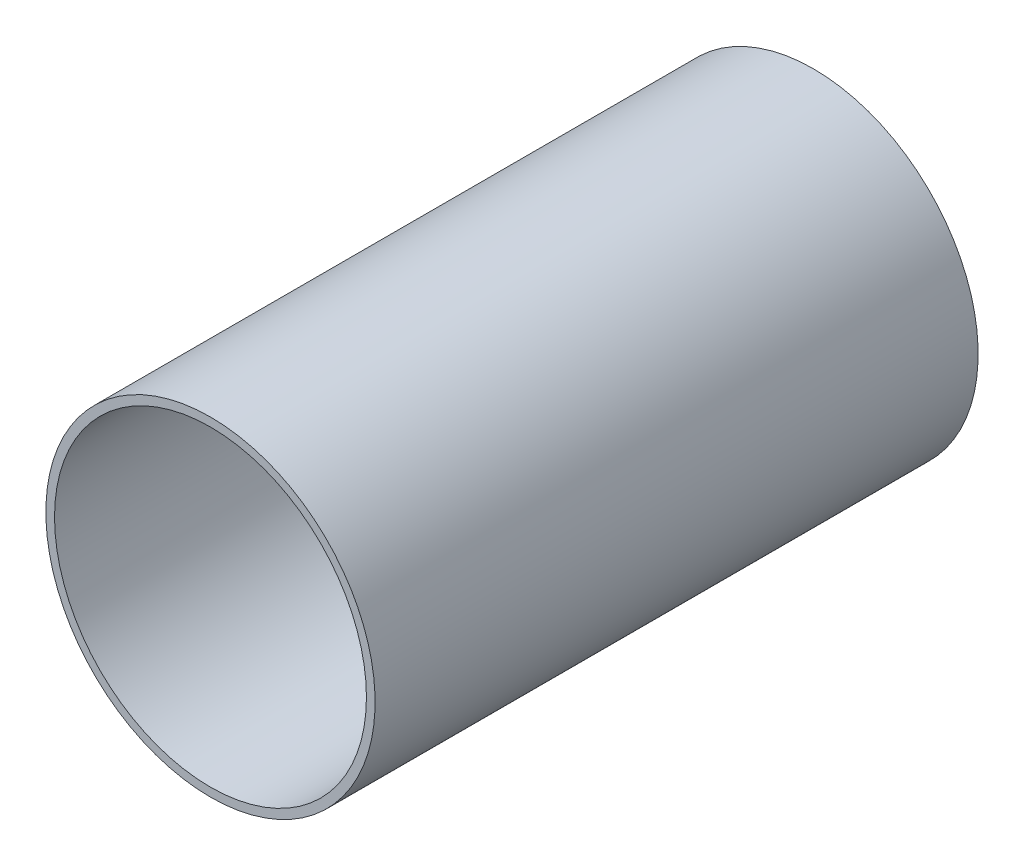
ISO-10303-21;
HEADER;
FILE_DESCRIPTION(('STEP AP214'),'2;1');
FILE_NAME('part.step','',(''),(''),'','','');
FILE_SCHEMA(('AUTOMOTIVE_DESIGN { 1 0 10303 214 1 1 1 1 }'));
ENDSEC;
DATA;
#1=APPLICATION_CONTEXT('core data for automotive mechanical design processes');
#2=APPLICATION_PROTOCOL_DEFINITION('international standard','automotive_design',2000,#1);
#3=PRODUCT_CONTEXT('',#1,'mechanical');
#4=PRODUCT('Part','Part','',(#3));
#5=PRODUCT_RELATED_PRODUCT_CATEGORY('part','',(#4));
#6=PRODUCT_DEFINITION_FORMATION('','',#4);
#7=PRODUCT_DEFINITION_CONTEXT('part definition',#1,'design');
#8=PRODUCT_DEFINITION('design','',#6,#7);
#9=PRODUCT_DEFINITION_SHAPE('','',#8);
#10=(LENGTH_UNIT() NAMED_UNIT(*) SI_UNIT(.MILLI.,.METRE.));
#11=(NAMED_UNIT(*) PLANE_ANGLE_UNIT() SI_UNIT($,.RADIAN.));
#12=(NAMED_UNIT(*) SI_UNIT($,.STERADIAN.) SOLID_ANGLE_UNIT());
#13=UNCERTAINTY_MEASURE_WITH_UNIT(LENGTH_MEASURE(1.E-05),#10,'distance_accuracy_value','');
#14=(GEOMETRIC_REPRESENTATION_CONTEXT(3) GLOBAL_UNCERTAINTY_ASSIGNED_CONTEXT((#13)) GLOBAL_UNIT_ASSIGNED_CONTEXT((#10,
#11,#12)) REPRESENTATION_CONTEXT('',''));
#15=CARTESIAN_POINT('',(0.,0.,0.));
#16=DIRECTION('',(0.,0.,1.));
#17=DIRECTION('',(1.,0.,0.));
#18=AXIS2_PLACEMENT_3D('',#15,#16,#17);
#19=CARTESIAN_POINT('',(177.26,-119.456,-0.045));
#20=DIRECTION('',(0.,0.,-1.));
#21=DIRECTION('',(0.,-1.,0.));
#22=AXIS2_PLACEMENT_3D('',#19,#20,#21);
#23=CYLINDRICAL_SURFACE('',#22,0.45);
#24=CARTESIAN_POINT('',(177.26,-119.456,-0.035));
#25=DIRECTION('',(0.,0.,-1.));
#26=DIRECTION('',(0.,-1.,0.));
#27=AXIS2_PLACEMENT_3D('',#24,#25,#26);
#28=CIRCLE('',#27,0.45);
#29=CARTESIAN_POINT('',(177.26,-119.906,-0.035));
#30=VERTEX_POINT('',#29);
#31=EDGE_CURVE('E65',#30,#30,#28,.T.);
#32=ORIENTED_EDGE('',*,*,#31,.T.);
#33=DIRECTION('',(0.,0.,1.));
#34=VECTOR('',#33,1.);
#35=CARTESIAN_POINT('',(177.26,-119.906,-0.045));
#36=LINE('',#35,#34);
#37=CARTESIAN_POINT('',(177.26,-119.906,1.705));
#38=VERTEX_POINT('',#37);
#39=EDGE_CURVE('E11',#30,#38,#36,.T.);
#40=ORIENTED_EDGE('',*,*,#39,.T.);
#41=CARTESIAN_POINT('',(177.26,-119.456,1.705));
#42=DIRECTION('',(0.,0.,-1.));
#43=DIRECTION('',(0.,-1.,0.));
#44=AXIS2_PLACEMENT_3D('',#41,#42,#43);
#45=CIRCLE('',#44,0.45);
#46=EDGE_CURVE('E26',#38,#38,#45,.T.);
#47=ORIENTED_EDGE('',*,*,#46,.F.);
#48=ORIENTED_EDGE('',*,*,#39,.F.);
#49=EDGE_LOOP('',(#32,#40,#47,#48));
#50=FACE_BOUND('',#49,.T.);
#51=ADVANCED_FACE('F17',(#50),#23,.F.);
#52=CARTESIAN_POINT('',(177.26,-119.931,1.705));
#53=DIRECTION('',(0.,0.,1.));
#54=DIRECTION('',(1.,0.,0.));
#55=AXIS2_PLACEMENT_3D('',#52,#53,#54);
#56=PLANE('',#55);
#57=ORIENTED_EDGE('',*,*,#46,.T.);
#58=EDGE_LOOP('',(#57));
#59=FACE_BOUND('',#58,.T.);
#60=CARTESIAN_POINT('',(177.26,-119.456,1.705));
#61=DIRECTION('',(0.,0.,1.));
#62=DIRECTION('',(0.,-1.,0.));
#63=AXIS2_PLACEMENT_3D('',#60,#61,#62);
#64=CIRCLE('',#63,0.475);
#65=CARTESIAN_POINT('',(177.26,-119.931,1.705));
#66=VERTEX_POINT('',#65);
#67=EDGE_CURVE('E57',#66,#66,#64,.T.);
#68=ORIENTED_EDGE('',*,*,#67,.T.);
#69=EDGE_LOOP('',(#68));
#70=FACE_BOUND('',#69,.T.);
#71=ADVANCED_FACE('F19',(#59,#70),#56,.T.);
#72=CARTESIAN_POINT('',(177.26,-119.931,-0.035));
#73=DIRECTION('',(0.,0.,1.));
#74=DIRECTION('',(1.,0.,0.));
#75=AXIS2_PLACEMENT_3D('',#72,#73,#74);
#76=PLANE('',#75);
#77=ORIENTED_EDGE('',*,*,#31,.F.);
#78=EDGE_LOOP('',(#77));
#79=FACE_BOUND('',#78,.T.);
#80=CARTESIAN_POINT('',(177.26,-119.456,-0.035));
#81=DIRECTION('',(0.,0.,1.));
#82=DIRECTION('',(0.,-1.,0.));
#83=AXIS2_PLACEMENT_3D('',#80,#81,#82);
#84=CIRCLE('',#83,0.475);
#85=CARTESIAN_POINT('',(177.26,-119.931,-0.035));
#86=VERTEX_POINT('',#85);
#87=EDGE_CURVE('E56',#86,#86,#84,.T.);
#88=ORIENTED_EDGE('',*,*,#87,.F.);
#89=EDGE_LOOP('',(#88));
#90=FACE_BOUND('',#89,.T.);
#91=ADVANCED_FACE('F78',(#79,#90),#76,.F.);
#92=CARTESIAN_POINT('',(177.26,-119.456,-0.035));
#93=DIRECTION('',(0.,0.,-1.));
#94=DIRECTION('',(0.,-1.,0.));
#95=AXIS2_PLACEMENT_3D('',#92,#93,#94);
#96=CYLINDRICAL_SURFACE('',#95,0.475);
#97=ORIENTED_EDGE('',*,*,#87,.T.);
#98=DIRECTION('',(0.,0.,1.));
#99=VECTOR('',#98,1.);
#100=CARTESIAN_POINT('',(177.26,-119.931,-0.035));
#101=LINE('',#100,#99);
#102=EDGE_CURVE('E53',#86,#66,#101,.T.);
#103=ORIENTED_EDGE('',*,*,#102,.T.);
#104=ORIENTED_EDGE('',*,*,#67,.F.);
#105=ORIENTED_EDGE('',*,*,#102,.F.);
#106=EDGE_LOOP('',(#97,#103,#104,#105));
#107=FACE_BOUND('',#106,.T.);
#108=ADVANCED_FACE('F54',(#107),#96,.T.);
#109=CLOSED_SHELL('',(#51,#71,#91,#108));
#110=MANIFOLD_SOLID_BREP('B1',#109);
#111=ADVANCED_BREP_SHAPE_REPRESENTATION('',(#18,#110),#14);
#112=SHAPE_DEFINITION_REPRESENTATION(#9,#111);
ENDSEC;
END-ISO-10303-21;
